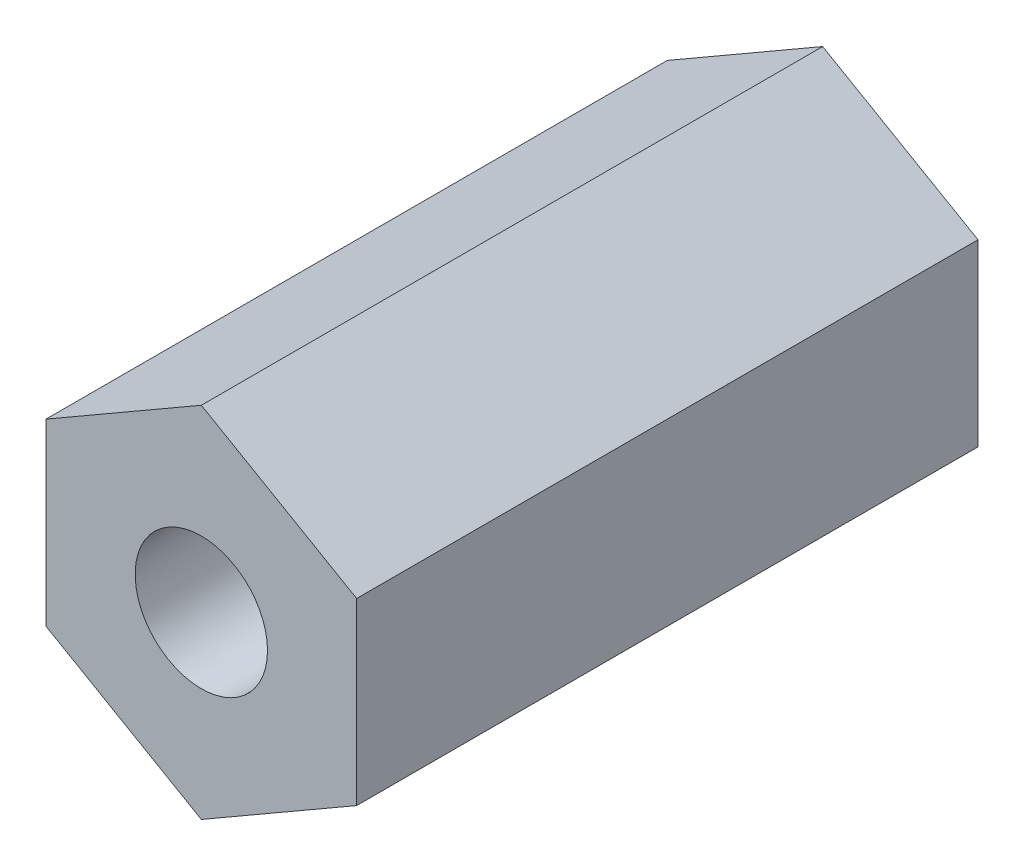
ISO-10303-21;
HEADER;
FILE_DESCRIPTION(('STEP AP214'),'2;1');
FILE_NAME('part.step','',(''),(''),'','','');
FILE_SCHEMA(('AUTOMOTIVE_DESIGN { 1 0 10303 214 1 1 1 1 }'));
ENDSEC;
DATA;
#1=APPLICATION_CONTEXT('core data for automotive mechanical design processes');
#2=APPLICATION_PROTOCOL_DEFINITION('international standard','automotive_design',2000,#1);
#3=PRODUCT_CONTEXT('',#1,'mechanical');
#4=PRODUCT('Part','Part','',(#3));
#5=PRODUCT_RELATED_PRODUCT_CATEGORY('part','',(#4));
#6=PRODUCT_DEFINITION_FORMATION('','',#4);
#7=PRODUCT_DEFINITION_CONTEXT('part definition',#1,'design');
#8=PRODUCT_DEFINITION('design','',#6,#7);
#9=PRODUCT_DEFINITION_SHAPE('','',#8);
#10=(LENGTH_UNIT() NAMED_UNIT(*) SI_UNIT(.MILLI.,.METRE.));
#11=(NAMED_UNIT(*) PLANE_ANGLE_UNIT() SI_UNIT($,.RADIAN.));
#12=(NAMED_UNIT(*) SI_UNIT($,.STERADIAN.) SOLID_ANGLE_UNIT());
#13=UNCERTAINTY_MEASURE_WITH_UNIT(LENGTH_MEASURE(1.E-05),#10,'distance_accuracy_value','');
#14=(GEOMETRIC_REPRESENTATION_CONTEXT(3) GLOBAL_UNCERTAINTY_ASSIGNED_CONTEXT((#13)) GLOBAL_UNIT_ASSIGNED_CONTEXT((#10,
#11,#12)) REPRESENTATION_CONTEXT('',''));
#15=CARTESIAN_POINT('',(0.,0.,0.));
#16=DIRECTION('',(0.,0.,1.));
#17=DIRECTION('',(1.,0.,0.));
#18=AXIS2_PLACEMENT_3D('',#15,#16,#17);
#19=CARTESIAN_POINT('',(3.175,1.83308710467706,12.7));
#20=DIRECTION('',(-0.5,-0.866025403784439,0.));
#21=DIRECTION('',(0.866025403784439,-0.5,0.));
#22=AXIS2_PLACEMENT_3D('',#19,#20,#21);
#23=PLANE('',#22);
#24=DIRECTION('',(-0.866025403784439,0.5,0.));
#25=VECTOR('',#24,1.);
#26=CARTESIAN_POINT('',(3.175,1.83308710467706,0.));
#27=LINE('',#26,#25);
#28=CARTESIAN_POINT('',(3.175,1.83308710467706,0.));
#29=VERTEX_POINT('',#28);
#30=CARTESIAN_POINT('',(0.,3.66617420935412,0.));
#31=VERTEX_POINT('',#30);
#32=EDGE_CURVE('E121',#29,#31,#27,.T.);
#33=ORIENTED_EDGE('',*,*,#32,.T.);
#34=DIRECTION('',(0.,0.,-1.));
#35=VECTOR('',#34,1.);
#36=CARTESIAN_POINT('',(0.,3.66617420935412,12.7));
#37=LINE('',#36,#35);
#38=CARTESIAN_POINT('',(0.,3.66617420935412,12.7));
#39=VERTEX_POINT('',#38);
#40=EDGE_CURVE('E11',#39,#31,#37,.T.);
#41=ORIENTED_EDGE('',*,*,#40,.F.);
#42=DIRECTION('',(-0.866025403784439,0.5,0.));
#43=VECTOR('',#42,1.);
#44=CARTESIAN_POINT('',(3.175,1.83308710467706,12.7));
#45=LINE('',#44,#43);
#46=CARTESIAN_POINT('',(3.175,1.83308710467706,12.7));
#47=VERTEX_POINT('',#46);
#48=EDGE_CURVE('E132',#47,#39,#45,.T.);
#49=ORIENTED_EDGE('',*,*,#48,.F.);
#50=DIRECTION('',(0.,0.,-1.));
#51=VECTOR('',#50,1.);
#52=CARTESIAN_POINT('',(3.175,1.83308710467706,12.7));
#53=LINE('',#52,#51);
#54=EDGE_CURVE('E117',#47,#29,#53,.T.);
#55=ORIENTED_EDGE('',*,*,#54,.T.);
#56=EDGE_LOOP('',(#33,#41,#49,#55));
#57=FACE_BOUND('',#56,.T.);
#58=ADVANCED_FACE('F37',(#57),#23,.F.);
#59=CARTESIAN_POINT('',(0.,3.66617420935412,12.7));
#60=DIRECTION('',(0.5,-0.866025403784439,0.));
#61=DIRECTION('',(0.866025403784439,0.5,0.));
#62=AXIS2_PLACEMENT_3D('',#59,#60,#61);
#63=PLANE('',#62);
#64=DIRECTION('',(-0.866025403784439,-0.5,0.));
#65=VECTOR('',#64,1.);
#66=CARTESIAN_POINT('',(0.,3.66617420935412,0.));
#67=LINE('',#66,#65);
#68=CARTESIAN_POINT('',(-3.175,1.83308710467706,0.));
#69=VERTEX_POINT('',#68);
#70=EDGE_CURVE('E124',#31,#69,#67,.T.);
#71=ORIENTED_EDGE('',*,*,#70,.T.);
#72=DIRECTION('',(0.,0.,-1.));
#73=VECTOR('',#72,1.);
#74=CARTESIAN_POINT('',(-3.175,1.83308710467706,12.7));
#75=LINE('',#74,#73);
#76=CARTESIAN_POINT('',(-3.175,1.83308710467706,12.7));
#77=VERTEX_POINT('',#76);
#78=EDGE_CURVE('E45',#77,#69,#75,.T.);
#79=ORIENTED_EDGE('',*,*,#78,.F.);
#80=DIRECTION('',(-0.866025403784439,-0.5,0.));
#81=VECTOR('',#80,1.);
#82=CARTESIAN_POINT('',(0.,3.66617420935412,12.7));
#83=LINE('',#82,#81);
#84=EDGE_CURVE('E90',#39,#77,#83,.T.);
#85=ORIENTED_EDGE('',*,*,#84,.F.);
#86=ORIENTED_EDGE('',*,*,#40,.T.);
#87=EDGE_LOOP('',(#71,#79,#85,#86));
#88=FACE_BOUND('',#87,.T.);
#89=ADVANCED_FACE('F157',(#88),#63,.F.);
#90=CARTESIAN_POINT('',(-3.175,1.83308710467706,12.7));
#91=DIRECTION('',(1.,0.,0.));
#92=DIRECTION('',(0.,0.,-1.));
#93=AXIS2_PLACEMENT_3D('',#90,#91,#92);
#94=PLANE('',#93);
#95=DIRECTION('',(0.,-1.,0.));
#96=VECTOR('',#95,1.);
#97=CARTESIAN_POINT('',(-3.175,1.83308710467706,0.));
#98=LINE('',#97,#96);
#99=CARTESIAN_POINT('',(-3.175,-1.83308710467706,0.));
#100=VERTEX_POINT('',#99);
#101=EDGE_CURVE('E127',#69,#100,#98,.T.);
#102=ORIENTED_EDGE('',*,*,#101,.T.);
#103=DIRECTION('',(0.,0.,-1.));
#104=VECTOR('',#103,1.);
#105=CARTESIAN_POINT('',(-3.175,-1.83308710467706,12.7));
#106=LINE('',#105,#104);
#107=CARTESIAN_POINT('',(-3.175,-1.83308710467706,12.7));
#108=VERTEX_POINT('',#107);
#109=EDGE_CURVE('E112',#108,#100,#106,.T.);
#110=ORIENTED_EDGE('',*,*,#109,.F.);
#111=DIRECTION('',(0.,-1.,0.));
#112=VECTOR('',#111,1.);
#113=CARTESIAN_POINT('',(-3.175,1.83308710467706,12.7));
#114=LINE('',#113,#112);
#115=EDGE_CURVE('E103',#77,#108,#114,.T.);
#116=ORIENTED_EDGE('',*,*,#115,.F.);
#117=ORIENTED_EDGE('',*,*,#78,.T.);
#118=EDGE_LOOP('',(#102,#110,#116,#117));
#119=FACE_BOUND('',#118,.T.);
#120=ADVANCED_FACE('F138',(#119),#94,.F.);
#121=CARTESIAN_POINT('',(-3.175,-1.83308710467706,12.7));
#122=DIRECTION('',(0.5,0.866025403784439,0.));
#123=DIRECTION('',(-0.866025403784439,0.5,0.));
#124=AXIS2_PLACEMENT_3D('',#121,#122,#123);
#125=PLANE('',#124);
#126=DIRECTION('',(0.866025403784439,-0.5,0.));
#127=VECTOR('',#126,1.);
#128=CARTESIAN_POINT('',(-3.175,-1.83308710467706,0.));
#129=LINE('',#128,#127);
#130=CARTESIAN_POINT('',(0.,-3.66617420935412,0.));
#131=VERTEX_POINT('',#130);
#132=EDGE_CURVE('E111',#100,#131,#129,.T.);
#133=ORIENTED_EDGE('',*,*,#132,.T.);
#134=DIRECTION('',(0.,0.,-1.));
#135=VECTOR('',#134,1.);
#136=CARTESIAN_POINT('',(0.,-3.66617420935412,12.7));
#137=LINE('',#136,#135);
#138=CARTESIAN_POINT('',(0.,-3.66617420935412,12.7));
#139=VERTEX_POINT('',#138);
#140=EDGE_CURVE('E108',#139,#131,#137,.T.);
#141=ORIENTED_EDGE('',*,*,#140,.F.);
#142=DIRECTION('',(0.866025403784439,-0.5,0.));
#143=VECTOR('',#142,1.);
#144=CARTESIAN_POINT('',(-3.175,-1.83308710467706,12.7));
#145=LINE('',#144,#143);
#146=EDGE_CURVE('E97',#108,#139,#145,.T.);
#147=ORIENTED_EDGE('',*,*,#146,.F.);
#148=ORIENTED_EDGE('',*,*,#109,.T.);
#149=EDGE_LOOP('',(#133,#141,#147,#148));
#150=FACE_BOUND('',#149,.T.);
#151=ADVANCED_FACE('F109',(#150),#125,.F.);
#152=CARTESIAN_POINT('',(0.,-3.66617420935412,12.7));
#153=DIRECTION('',(-0.5,0.866025403784439,0.));
#154=DIRECTION('',(-0.866025403784439,-0.5,0.));
#155=AXIS2_PLACEMENT_3D('',#152,#153,#154);
#156=PLANE('',#155);
#157=DIRECTION('',(0.866025403784439,0.5,0.));
#158=VECTOR('',#157,1.);
#159=CARTESIAN_POINT('',(0.,-3.66617420935412,0.));
#160=LINE('',#159,#158);
#161=CARTESIAN_POINT('',(3.175,-1.83308710467706,0.));
#162=VERTEX_POINT('',#161);
#163=EDGE_CURVE('E76',#131,#162,#160,.T.);
#164=ORIENTED_EDGE('',*,*,#163,.T.);
#165=DIRECTION('',(0.,0.,-1.));
#166=VECTOR('',#165,1.);
#167=CARTESIAN_POINT('',(3.175,-1.83308710467706,12.7));
#168=LINE('',#167,#166);
#169=CARTESIAN_POINT('',(3.175,-1.83308710467706,12.7));
#170=VERTEX_POINT('',#169);
#171=EDGE_CURVE('E113',#170,#162,#168,.T.);
#172=ORIENTED_EDGE('',*,*,#171,.F.);
#173=DIRECTION('',(0.866025403784439,0.5,0.));
#174=VECTOR('',#173,1.);
#175=CARTESIAN_POINT('',(0.,-3.66617420935412,12.7));
#176=LINE('',#175,#174);
#177=EDGE_CURVE('E101',#139,#170,#176,.T.);
#178=ORIENTED_EDGE('',*,*,#177,.F.);
#179=ORIENTED_EDGE('',*,*,#140,.T.);
#180=EDGE_LOOP('',(#164,#172,#178,#179));
#181=FACE_BOUND('',#180,.T.);
#182=ADVANCED_FACE('F115',(#181),#156,.F.);
#183=CARTESIAN_POINT('',(3.175,-1.83308710467706,12.7));
#184=DIRECTION('',(-1.,0.,0.));
#185=DIRECTION('',(0.,-1.,0.));
#186=AXIS2_PLACEMENT_3D('',#183,#184,#185);
#187=PLANE('',#186);
#188=DIRECTION('',(0.,1.,0.));
#189=VECTOR('',#188,1.);
#190=CARTESIAN_POINT('',(3.175,-1.83308710467706,0.));
#191=LINE('',#190,#189);
#192=EDGE_CURVE('E82',#162,#29,#191,.T.);
#193=ORIENTED_EDGE('',*,*,#192,.T.);
#194=ORIENTED_EDGE('',*,*,#54,.F.);
#195=DIRECTION('',(0.,1.,0.));
#196=VECTOR('',#195,1.);
#197=CARTESIAN_POINT('',(3.175,-1.83308710467706,12.7));
#198=LINE('',#197,#196);
#199=EDGE_CURVE('E53',#170,#47,#198,.T.);
#200=ORIENTED_EDGE('',*,*,#199,.F.);
#201=ORIENTED_EDGE('',*,*,#171,.T.);
#202=EDGE_LOOP('',(#193,#194,#200,#201));
#203=FACE_BOUND('',#202,.T.);
#204=ADVANCED_FACE('F145',(#203),#187,.F.);
#205=CARTESIAN_POINT('',(0.,0.,12.7));
#206=DIRECTION('',(0.,0.,1.));
#207=DIRECTION('',(1.,0.,0.));
#208=AXIS2_PLACEMENT_3D('',#205,#206,#207);
#209=PLANE('',#208);
#210=CARTESIAN_POINT('',(0.,0.,12.7));
#211=DIRECTION('',(0.,0.,1.));
#212=DIRECTION('',(1.,0.,0.));
#213=AXIS2_PLACEMENT_3D('',#210,#211,#212);
#214=CIRCLE('',#213,1.35255);
#215=CARTESIAN_POINT('',(1.35255,0.,12.7));
#216=VERTEX_POINT('',#215);
#217=EDGE_CURVE('E214',#216,#216,#214,.T.);
#218=ORIENTED_EDGE('',*,*,#217,.F.);
#219=EDGE_LOOP('',(#218));
#220=FACE_BOUND('',#219,.T.);
#221=ORIENTED_EDGE('',*,*,#48,.T.);
#222=ORIENTED_EDGE('',*,*,#84,.T.);
#223=ORIENTED_EDGE('',*,*,#115,.T.);
#224=ORIENTED_EDGE('',*,*,#146,.T.);
#225=ORIENTED_EDGE('',*,*,#177,.T.);
#226=ORIENTED_EDGE('',*,*,#199,.T.);
#227=EDGE_LOOP('',(#221,#222,#223,#224,#225,#226));
#228=FACE_BOUND('',#227,.T.);
#229=ADVANCED_FACE('F99',(#220,#228),#209,.T.);
#230=CARTESIAN_POINT('',(0.,0.,0.));
#231=DIRECTION('',(0.,0.,1.));
#232=DIRECTION('',(1.,0.,0.));
#233=AXIS2_PLACEMENT_3D('',#230,#231,#232);
#234=PLANE('',#233);
#235=CARTESIAN_POINT('',(0.,0.,0.));
#236=DIRECTION('',(0.,0.,1.));
#237=DIRECTION('',(1.,0.,0.));
#238=AXIS2_PLACEMENT_3D('',#235,#236,#237);
#239=CIRCLE('',#238,1.35255);
#240=CARTESIAN_POINT('',(1.35255,0.,0.));
#241=VERTEX_POINT('',#240);
#242=EDGE_CURVE('E125',#241,#241,#239,.T.);
#243=ORIENTED_EDGE('',*,*,#242,.T.);
#244=EDGE_LOOP('',(#243));
#245=FACE_BOUND('',#244,.T.);
#246=ORIENTED_EDGE('',*,*,#32,.F.);
#247=ORIENTED_EDGE('',*,*,#192,.F.);
#248=ORIENTED_EDGE('',*,*,#163,.F.);
#249=ORIENTED_EDGE('',*,*,#132,.F.);
#250=ORIENTED_EDGE('',*,*,#101,.F.);
#251=ORIENTED_EDGE('',*,*,#70,.F.);
#252=EDGE_LOOP('',(#246,#247,#248,#249,#250,#251));
#253=FACE_BOUND('',#252,.T.);
#254=ADVANCED_FACE('F141',(#245,#253),#234,.F.);
#255=CARTESIAN_POINT('',(0.,0.,12.7));
#256=DIRECTION('',(0.,0.,1.));
#257=DIRECTION('',(1.,0.,0.));
#258=AXIS2_PLACEMENT_3D('',#255,#256,#257);
#259=CYLINDRICAL_SURFACE('',#258,1.35255);
#260=ORIENTED_EDGE('',*,*,#242,.F.);
#261=EDGE_LOOP('',(#260));
#262=FACE_BOUND('',#261,.T.);
#263=ORIENTED_EDGE('',*,*,#217,.T.);
#264=EDGE_LOOP('',(#263));
#265=FACE_BOUND('',#264,.T.);
#266=ADVANCED_FACE('F194',(#262,#265),#259,.F.);
#267=CLOSED_SHELL('',(#58,#89,#120,#151,#182,#204,#229,#254,#266));
#268=MANIFOLD_SOLID_BREP('B2',#267);
#269=ADVANCED_BREP_SHAPE_REPRESENTATION('',(#18,#268),#14);
#270=SHAPE_DEFINITION_REPRESENTATION(#9,#269);
ENDSEC;
END-ISO-10303-21;
